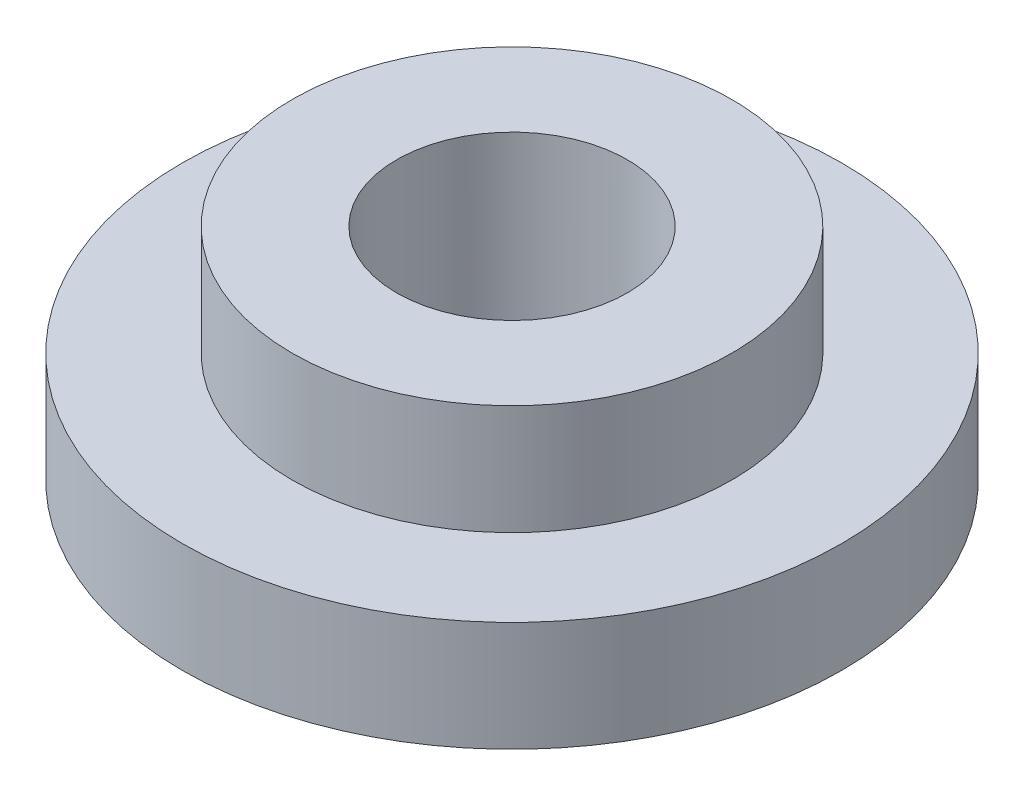
ISO-10303-21;
HEADER;
FILE_DESCRIPTION(('STEP AP214'),'2;1');
FILE_NAME('part.step','',(''),(''),'','','');
FILE_SCHEMA(('AUTOMOTIVE_DESIGN { 1 0 10303 214 1 1 1 1 }'));
ENDSEC;
DATA;
#1=APPLICATION_CONTEXT('core data for automotive mechanical design processes');
#2=APPLICATION_PROTOCOL_DEFINITION('international standard','automotive_design',2000,#1);
#3=PRODUCT_CONTEXT('',#1,'mechanical');
#4=PRODUCT('Part','Part','',(#3));
#5=PRODUCT_RELATED_PRODUCT_CATEGORY('part','',(#4));
#6=PRODUCT_DEFINITION_FORMATION('','',#4);
#7=PRODUCT_DEFINITION_CONTEXT('part definition',#1,'design');
#8=PRODUCT_DEFINITION('design','',#6,#7);
#9=PRODUCT_DEFINITION_SHAPE('','',#8);
#10=(LENGTH_UNIT() NAMED_UNIT(*) SI_UNIT(.MILLI.,.METRE.));
#11=(NAMED_UNIT(*) PLANE_ANGLE_UNIT() SI_UNIT($,.RADIAN.));
#12=(NAMED_UNIT(*) SI_UNIT($,.STERADIAN.) SOLID_ANGLE_UNIT());
#13=UNCERTAINTY_MEASURE_WITH_UNIT(LENGTH_MEASURE(1.E-05),#10,'distance_accuracy_value','');
#14=(GEOMETRIC_REPRESENTATION_CONTEXT(3) GLOBAL_UNCERTAINTY_ASSIGNED_CONTEXT((#13)) GLOBAL_UNIT_ASSIGNED_CONTEXT((#10,
#11,#12)) REPRESENTATION_CONTEXT('',''));
#15=CARTESIAN_POINT('',(0.,0.,0.));
#16=DIRECTION('',(0.,0.,1.));
#17=DIRECTION('',(1.,0.,0.));
#18=AXIS2_PLACEMENT_3D('',#15,#16,#17);
#19=CARTESIAN_POINT('',(0.,0.,0.));
#20=DIRECTION('',(0.,1.,0.));
#21=DIRECTION('',(0.,0.,1.));
#22=AXIS2_PLACEMENT_3D('',#19,#20,#21);
#23=PLANE('',#22);
#24=CARTESIAN_POINT('',(0.,0.,0.));
#25=DIRECTION('',(0.,1.,0.));
#26=DIRECTION('',(0.,0.,1.));
#27=AXIS2_PLACEMENT_3D('',#24,#25,#26);
#28=CIRCLE('',#27,6.);
#29=CARTESIAN_POINT('',(0.,0.,6.));
#30=VERTEX_POINT('',#29);
#31=EDGE_CURVE('E58',#30,#30,#28,.T.);
#32=ORIENTED_EDGE('',*,*,#31,.F.);
#33=EDGE_LOOP('',(#32));
#34=FACE_BOUND('',#33,.T.);
#35=CARTESIAN_POINT('',(0.,0.,0.));
#36=DIRECTION('',(0.,1.,0.));
#37=DIRECTION('',(0.,0.,1.));
#38=AXIS2_PLACEMENT_3D('',#35,#36,#37);
#39=CIRCLE('',#38,3.5);
#40=CARTESIAN_POINT('',(0.,0.,3.5));
#41=VERTEX_POINT('',#40);
#42=EDGE_CURVE('E10',#41,#41,#39,.F.);
#43=ORIENTED_EDGE('',*,*,#42,.F.);
#44=EDGE_LOOP('',(#43));
#45=FACE_BOUND('',#44,.T.);
#46=ADVANCED_FACE('F39',(#34,#45),#23,.F.);
#47=CARTESIAN_POINT('',(0.,2.,0.));
#48=DIRECTION('',(0.,-1.,0.));
#49=DIRECTION('',(0.,0.,-1.));
#50=AXIS2_PLACEMENT_3D('',#47,#48,#49);
#51=CYLINDRICAL_SURFACE('',#50,6.);
#52=CARTESIAN_POINT('',(0.,2.,0.));
#53=DIRECTION('',(0.,1.,0.));
#54=DIRECTION('',(0.,0.,1.));
#55=AXIS2_PLACEMENT_3D('',#52,#53,#54);
#56=CIRCLE('',#55,6.);
#57=CARTESIAN_POINT('',(0.,2.,6.));
#58=VERTEX_POINT('',#57);
#59=EDGE_CURVE('E52',#58,#58,#56,.T.);
#60=ORIENTED_EDGE('',*,*,#59,.F.);
#61=EDGE_LOOP('',(#60));
#62=FACE_BOUND('',#61,.T.);
#63=ORIENTED_EDGE('',*,*,#31,.T.);
#64=EDGE_LOOP('',(#63));
#65=FACE_BOUND('',#64,.T.);
#66=ADVANCED_FACE('F41',(#62,#65),#51,.T.);
#67=CARTESIAN_POINT('',(0.,2.,0.));
#68=DIRECTION('',(0.,1.,0.));
#69=DIRECTION('',(0.,0.,1.));
#70=AXIS2_PLACEMENT_3D('',#67,#68,#69);
#71=PLANE('',#70);
#72=CARTESIAN_POINT('',(0.,2.,0.));
#73=DIRECTION('',(0.,1.,0.));
#74=DIRECTION('',(0.,0.,1.));
#75=AXIS2_PLACEMENT_3D('',#72,#73,#74);
#76=CIRCLE('',#75,4.);
#77=CARTESIAN_POINT('',(0.,2.,4.));
#78=VERTEX_POINT('',#77);
#79=EDGE_CURVE('E47',#78,#78,#76,.T.);
#80=ORIENTED_EDGE('',*,*,#79,.F.);
#81=EDGE_LOOP('',(#80));
#82=FACE_BOUND('',#81,.T.);
#83=ORIENTED_EDGE('',*,*,#59,.T.);
#84=EDGE_LOOP('',(#83));
#85=FACE_BOUND('',#84,.T.);
#86=ADVANCED_FACE('F103',(#82,#85),#71,.T.);
#87=CARTESIAN_POINT('',(0.,4.,0.));
#88=DIRECTION('',(0.,-1.,0.));
#89=DIRECTION('',(0.,0.,-1.));
#90=AXIS2_PLACEMENT_3D('',#87,#88,#89);
#91=CYLINDRICAL_SURFACE('',#90,4.);
#92=CARTESIAN_POINT('',(0.,4.,0.));
#93=DIRECTION('',(0.,1.,0.));
#94=DIRECTION('',(0.,0.,1.));
#95=AXIS2_PLACEMENT_3D('',#92,#93,#94);
#96=CIRCLE('',#95,4.);
#97=CARTESIAN_POINT('',(0.,4.,4.));
#98=VERTEX_POINT('',#97);
#99=EDGE_CURVE('E61',#98,#98,#96,.T.);
#100=ORIENTED_EDGE('',*,*,#99,.F.);
#101=EDGE_LOOP('',(#100));
#102=FACE_BOUND('',#101,.T.);
#103=ORIENTED_EDGE('',*,*,#79,.T.);
#104=EDGE_LOOP('',(#103));
#105=FACE_BOUND('',#104,.T.);
#106=ADVANCED_FACE('F110',(#102,#105),#91,.T.);
#107=CARTESIAN_POINT('',(0.,4.,0.));
#108=DIRECTION('',(0.,1.,0.));
#109=DIRECTION('',(0.,0.,1.));
#110=AXIS2_PLACEMENT_3D('',#107,#108,#109);
#111=PLANE('',#110);
#112=CARTESIAN_POINT('',(0.,4.,0.));
#113=DIRECTION('',(0.,1.,0.));
#114=DIRECTION('',(0.,0.,1.));
#115=AXIS2_PLACEMENT_3D('',#112,#113,#114);
#116=CIRCLE('',#115,2.1);
#117=CARTESIAN_POINT('',(0.,4.,2.1));
#118=VERTEX_POINT('',#117);
#119=EDGE_CURVE('E66',#118,#118,#116,.T.);
#120=ORIENTED_EDGE('',*,*,#119,.F.);
#121=EDGE_LOOP('',(#120));
#122=FACE_BOUND('',#121,.T.);
#123=ORIENTED_EDGE('',*,*,#99,.T.);
#124=EDGE_LOOP('',(#123));
#125=FACE_BOUND('',#124,.T.);
#126=ADVANCED_FACE('F96',(#122,#125),#111,.T.);
#127=CARTESIAN_POINT('',(0.,0.,0.));
#128=DIRECTION('',(0.,1.,0.));
#129=DIRECTION('',(0.,0.,1.));
#130=AXIS2_PLACEMENT_3D('',#127,#128,#129);
#131=CYLINDRICAL_SURFACE('',#130,2.1);
#132=ORIENTED_EDGE('',*,*,#119,.T.);
#133=EDGE_LOOP('',(#132));
#134=FACE_BOUND('',#133,.T.);
#135=CARTESIAN_POINT('',(0.,-1.,0.));
#136=DIRECTION('',(0.,-1.,0.));
#137=DIRECTION('',(0.,0.,-1.));
#138=AXIS2_PLACEMENT_3D('',#135,#136,#137);
#139=CIRCLE('',#138,2.1);
#140=CARTESIAN_POINT('',(0.,-1.,-2.1));
#141=VERTEX_POINT('',#140);
#142=EDGE_CURVE('E76',#141,#141,#139,.T.);
#143=ORIENTED_EDGE('',*,*,#142,.T.);
#144=EDGE_LOOP('',(#143));
#145=FACE_BOUND('',#144,.T.);
#146=ADVANCED_FACE('F84',(#134,#145),#131,.F.);
#147=CARTESIAN_POINT('',(0.,-1.,0.));
#148=DIRECTION('',(0.,-1.,0.));
#149=DIRECTION('',(0.,0.,-1.));
#150=AXIS2_PLACEMENT_3D('',#147,#148,#149);
#151=PLANE('',#150);
#152=CARTESIAN_POINT('',(0.,-1.,0.));
#153=DIRECTION('',(0.,-1.,0.));
#154=DIRECTION('',(0.,0.,-1.));
#155=AXIS2_PLACEMENT_3D('',#152,#153,#154);
#156=CIRCLE('',#155,3.5);
#157=CARTESIAN_POINT('',(0.,-1.,-3.5));
#158=VERTEX_POINT('',#157);
#159=EDGE_CURVE('E69',#158,#158,#156,.T.);
#160=ORIENTED_EDGE('',*,*,#159,.T.);
#161=EDGE_LOOP('',(#160));
#162=FACE_BOUND('',#161,.T.);
#163=ORIENTED_EDGE('',*,*,#142,.F.);
#164=EDGE_LOOP('',(#163));
#165=FACE_BOUND('',#164,.T.);
#166=ADVANCED_FACE('F86',(#162,#165),#151,.T.);
#167=CARTESIAN_POINT('',(0.,-1.,0.));
#168=DIRECTION('',(0.,1.,0.));
#169=DIRECTION('',(0.,0.,1.));
#170=AXIS2_PLACEMENT_3D('',#167,#168,#169);
#171=CYLINDRICAL_SURFACE('',#170,3.5);
#172=ORIENTED_EDGE('',*,*,#159,.F.);
#173=EDGE_LOOP('',(#172));
#174=FACE_BOUND('',#173,.T.);
#175=ORIENTED_EDGE('',*,*,#42,.T.);
#176=EDGE_LOOP('',(#175));
#177=FACE_BOUND('',#176,.T.);
#178=ADVANCED_FACE('F88',(#174,#177),#171,.T.);
#179=CLOSED_SHELL('',(#46,#66,#86,#106,#126,#146,#166,#178));
#180=MANIFOLD_SOLID_BREP('B2',#179);
#181=ADVANCED_BREP_SHAPE_REPRESENTATION('',(#18,#180),#14);
#182=SHAPE_DEFINITION_REPRESENTATION(#9,#181);
ENDSEC;
END-ISO-10303-21;
